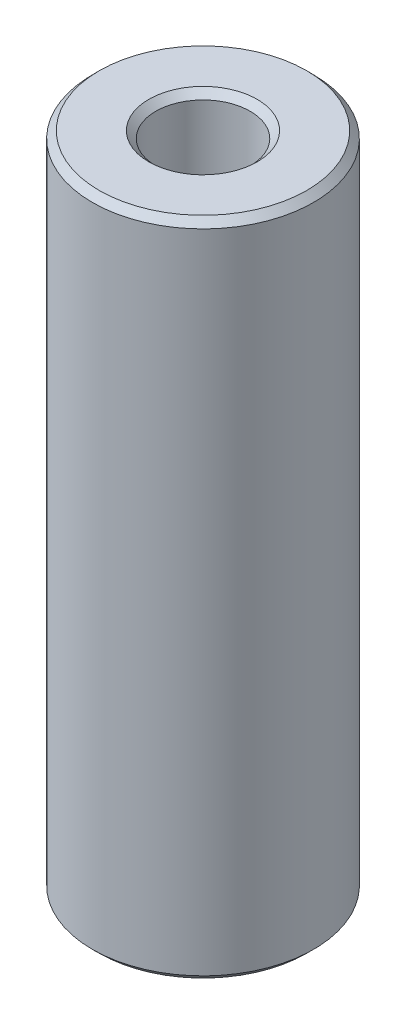
ISO-10303-21;
HEADER;
FILE_DESCRIPTION(('STEP AP214'),'2;1');
FILE_NAME('part.step','',(''),(''),'','','');
FILE_SCHEMA(('AUTOMOTIVE_DESIGN { 1 0 10303 214 1 1 1 1 }'));
ENDSEC;
DATA;
#1=APPLICATION_CONTEXT('core data for automotive mechanical design processes');
#2=APPLICATION_PROTOCOL_DEFINITION('international standard','automotive_design',2000,#1);
#3=PRODUCT_CONTEXT('',#1,'mechanical');
#4=PRODUCT('Part','Part','',(#3));
#5=PRODUCT_RELATED_PRODUCT_CATEGORY('part','',(#4));
#6=PRODUCT_DEFINITION_FORMATION('','',#4);
#7=PRODUCT_DEFINITION_CONTEXT('part definition',#1,'design');
#8=PRODUCT_DEFINITION('design','',#6,#7);
#9=PRODUCT_DEFINITION_SHAPE('','',#8);
#10=(LENGTH_UNIT() NAMED_UNIT(*) SI_UNIT(.MILLI.,.METRE.));
#11=(NAMED_UNIT(*) PLANE_ANGLE_UNIT() SI_UNIT($,.RADIAN.));
#12=(NAMED_UNIT(*) SI_UNIT($,.STERADIAN.) SOLID_ANGLE_UNIT());
#13=UNCERTAINTY_MEASURE_WITH_UNIT(LENGTH_MEASURE(1.E-05),#10,'distance_accuracy_value','');
#14=(GEOMETRIC_REPRESENTATION_CONTEXT(3) GLOBAL_UNCERTAINTY_ASSIGNED_CONTEXT((#13)) GLOBAL_UNIT_ASSIGNED_CONTEXT((#10,
#11,#12)) REPRESENTATION_CONTEXT('',''));
#15=CARTESIAN_POINT('',(0.,0.,0.));
#16=DIRECTION('',(0.,0.,1.));
#17=DIRECTION('',(1.,0.,0.));
#18=AXIS2_PLACEMENT_3D('',#15,#16,#17);
#19=CARTESIAN_POINT('',(0.,313.638153725455,0.));
#20=DIRECTION('',(0.,-1.,0.));
#21=DIRECTION('',(0.,0.,-1.));
#22=AXIS2_PLACEMENT_3D('',#19,#20,#21);
#23=CYLINDRICAL_SURFACE('',#22,52.5);
#24=CARTESIAN_POINT('',(0.,3.24823430610671,0.));
#25=DIRECTION('',(0.,1.,0.));
#26=DIRECTION('',(0.,0.,1.));
#27=AXIS2_PLACEMENT_3D('',#24,#25,#26);
#28=CIRCLE('',#27,52.5);
#29=CARTESIAN_POINT('',(0.,3.24823430610671,52.5));
#30=VERTEX_POINT('',#29);
#31=EDGE_CURVE('E10',#30,#30,#28,.T.);
#32=ORIENTED_EDGE('',*,*,#31,.T.);
#33=EDGE_LOOP('',(#32));
#34=FACE_BOUND('',#33,.T.);
#35=CARTESIAN_POINT('',(0.,310.335829580625,0.));
#36=DIRECTION('',(0.,1.,0.));
#37=DIRECTION('',(0.,0.,1.));
#38=AXIS2_PLACEMENT_3D('',#35,#36,#37);
#39=CIRCLE('',#38,52.5);
#40=CARTESIAN_POINT('',(0.,310.335829580625,52.5));
#41=VERTEX_POINT('',#40);
#42=EDGE_CURVE('E50',#41,#41,#39,.F.);
#43=ORIENTED_EDGE('',*,*,#42,.T.);
#44=EDGE_LOOP('',(#43));
#45=FACE_BOUND('',#44,.T.);
#46=ADVANCED_FACE('F39',(#34,#45),#23,.T.);
#47=CARTESIAN_POINT('',(0.,313.638153725455,0.));
#48=DIRECTION('',(0.,1.,0.));
#49=DIRECTION('',(0.,0.,1.));
#50=AXIS2_PLACEMENT_3D('',#47,#48,#49);
#51=PLANE('',#50);
#52=CARTESIAN_POINT('',(0.,313.638153725455,0.));
#53=DIRECTION('',(0.,1.,0.));
#54=DIRECTION('',(0.,0.,1.));
#55=AXIS2_PLACEMENT_3D('',#52,#53,#54);
#56=CIRCLE('',#55,25.7268826321038);
#57=CARTESIAN_POINT('',(0.,313.638153725455,25.7268826321038));
#58=VERTEX_POINT('',#57);
#59=EDGE_CURVE('E58',#58,#58,#56,.F.);
#60=ORIENTED_EDGE('',*,*,#59,.T.);
#61=EDGE_LOOP('',(#60));
#62=FACE_BOUND('',#61,.T.);
#63=CARTESIAN_POINT('',(0.,313.638153725455,0.));
#64=DIRECTION('',(0.,1.,0.));
#65=DIRECTION('',(0.,0.,1.));
#66=AXIS2_PLACEMENT_3D('',#63,#64,#65);
#67=CIRCLE('',#66,49.2517656938933);
#68=CARTESIAN_POINT('',(0.,313.638153725455,49.2517656938933));
#69=VERTEX_POINT('',#68);
#70=EDGE_CURVE('E61',#69,#69,#67,.T.);
#71=ORIENTED_EDGE('',*,*,#70,.T.);
#72=EDGE_LOOP('',(#71));
#73=FACE_BOUND('',#72,.T.);
#74=ADVANCED_FACE('F88',(#62,#73),#51,.T.);
#75=CARTESIAN_POINT('',(0.,0.,0.));
#76=DIRECTION('',(0.,1.,0.));
#77=DIRECTION('',(0.,0.,1.));
#78=AXIS2_PLACEMENT_3D('',#75,#76,#77);
#79=PLANE('',#78);
#80=CARTESIAN_POINT('',(0.,0.,0.));
#81=DIRECTION('',(0.,1.,0.));
#82=DIRECTION('',(0.,0.,1.));
#83=AXIS2_PLACEMENT_3D('',#80,#81,#82);
#84=CIRCLE('',#83,25.6727927933797);
#85=CARTESIAN_POINT('',(0.,0.,25.6727927933797));
#86=VERTEX_POINT('',#85);
#87=EDGE_CURVE('E51',#86,#86,#84,.T.);
#88=ORIENTED_EDGE('',*,*,#87,.T.);
#89=EDGE_LOOP('',(#88));
#90=FACE_BOUND('',#89,.T.);
#91=CARTESIAN_POINT('',(0.,0.,0.));
#92=DIRECTION('',(0.,1.,0.));
#93=DIRECTION('',(0.,0.,1.));
#94=AXIS2_PLACEMENT_3D('',#91,#92,#93);
#95=CIRCLE('',#94,49.1976758551691);
#96=CARTESIAN_POINT('',(0.,0.,49.1976758551691));
#97=VERTEX_POINT('',#96);
#98=EDGE_CURVE('E54',#97,#97,#95,.F.);
#99=ORIENTED_EDGE('',*,*,#98,.T.);
#100=EDGE_LOOP('',(#99));
#101=FACE_BOUND('',#100,.T.);
#102=ADVANCED_FACE('F83',(#90,#101),#79,.F.);
#103=CARTESIAN_POINT('',(0.,313.638153725455,0.));
#104=DIRECTION('',(0.,-1.,0.));
#105=DIRECTION('',(0.,0.,-1.));
#106=AXIS2_PLACEMENT_3D('',#103,#104,#105);
#107=CYLINDRICAL_SURFACE('',#106,22.4245584872731);
#108=CARTESIAN_POINT('',(0.,310.389919419349,0.));
#109=DIRECTION('',(0.,1.,0.));
#110=DIRECTION('',(0.,0.,1.));
#111=AXIS2_PLACEMENT_3D('',#108,#109,#110);
#112=CIRCLE('',#111,22.4245584872731);
#113=CARTESIAN_POINT('',(0.,310.389919419349,22.4245584872731));
#114=VERTEX_POINT('',#113);
#115=EDGE_CURVE('E67',#114,#114,#112,.T.);
#116=ORIENTED_EDGE('',*,*,#115,.T.);
#117=EDGE_LOOP('',(#116));
#118=FACE_BOUND('',#117,.T.);
#119=CARTESIAN_POINT('',(0.,3.30232414483073,0.));
#120=DIRECTION('',(0.,1.,0.));
#121=DIRECTION('',(0.,0.,1.));
#122=AXIS2_PLACEMENT_3D('',#119,#120,#121);
#123=CIRCLE('',#122,22.4245584872731);
#124=CARTESIAN_POINT('',(0.,3.30232414483073,22.4245584872731));
#125=VERTEX_POINT('',#124);
#126=EDGE_CURVE('E69',#125,#125,#123,.F.);
#127=ORIENTED_EDGE('',*,*,#126,.T.);
#128=EDGE_LOOP('',(#127));
#129=FACE_BOUND('',#128,.T.);
#130=ADVANCED_FACE('F71',(#118,#129),#107,.F.);
#131=CARTESIAN_POINT('',(0.,310.389919419349,0.));
#132=DIRECTION('',(0.,1.,0.));
#133=DIRECTION('',(0.,0.,1.));
#134=AXIS2_PLACEMENT_3D('',#131,#132,#133);
#135=CONICAL_SURFACE('',#134,22.4245584872731,0.793655262368115);
#136=ORIENTED_EDGE('',*,*,#59,.F.);
#137=EDGE_LOOP('',(#136));
#138=FACE_BOUND('',#137,.T.);
#139=ORIENTED_EDGE('',*,*,#115,.F.);
#140=EDGE_LOOP('',(#139));
#141=FACE_BOUND('',#140,.T.);
#142=ADVANCED_FACE('F77',(#138,#141),#135,.F.);
#143=CARTESIAN_POINT('',(0.,0.,0.));
#144=DIRECTION('',(0.,-1.,0.));
#145=DIRECTION('',(0.,0.,-1.));
#146=AXIS2_PLACEMENT_3D('',#143,#144,#145);
#147=CONICAL_SURFACE('',#146,25.6727927933797,0.777141064426787);
#148=ORIENTED_EDGE('',*,*,#126,.F.);
#149=EDGE_LOOP('',(#148));
#150=FACE_BOUND('',#149,.T.);
#151=ORIENTED_EDGE('',*,*,#87,.F.);
#152=EDGE_LOOP('',(#151));
#153=FACE_BOUND('',#152,.T.);
#154=ADVANCED_FACE('F73',(#150,#153),#147,.F.);
#155=CARTESIAN_POINT('',(0.,3.24823430610671,0.));
#156=DIRECTION('',(0.,1.,0.));
#157=DIRECTION('',(0.,0.,1.));
#158=AXIS2_PLACEMENT_3D('',#155,#156,#157);
#159=CONICAL_SURFACE('',#158,52.5,0.793655262368118);
#160=ORIENTED_EDGE('',*,*,#98,.F.);
#161=EDGE_LOOP('',(#160));
#162=FACE_BOUND('',#161,.T.);
#163=ORIENTED_EDGE('',*,*,#31,.F.);
#164=EDGE_LOOP('',(#163));
#165=FACE_BOUND('',#164,.T.);
#166=ADVANCED_FACE('F76',(#162,#165),#159,.T.);
#167=CARTESIAN_POINT('',(0.,313.638153725455,0.));
#168=DIRECTION('',(0.,-1.,0.));
#169=DIRECTION('',(0.,0.,-1.));
#170=AXIS2_PLACEMENT_3D('',#167,#168,#169);
#171=CONICAL_SURFACE('',#170,49.2517656938933,0.777141064426794);
#172=ORIENTED_EDGE('',*,*,#42,.F.);
#173=EDGE_LOOP('',(#172));
#174=FACE_BOUND('',#173,.T.);
#175=ORIENTED_EDGE('',*,*,#70,.F.);
#176=EDGE_LOOP('',(#175));
#177=FACE_BOUND('',#176,.T.);
#178=ADVANCED_FACE('F45',(#174,#177),#171,.T.);
#179=CLOSED_SHELL('',(#46,#74,#102,#130,#142,#154,#166,#178));
#180=MANIFOLD_SOLID_BREP('B2',#179);
#181=ADVANCED_BREP_SHAPE_REPRESENTATION('',(#18,#180),#14);
#182=SHAPE_DEFINITION_REPRESENTATION(#9,#181);
ENDSEC;
END-ISO-10303-21;
